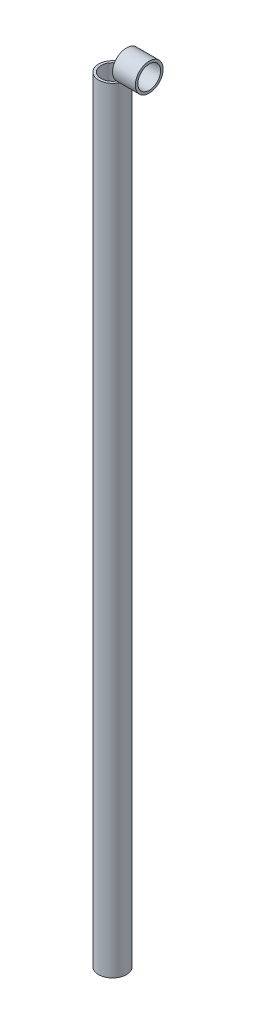
ISO-10303-21;
HEADER;
FILE_DESCRIPTION(('STEP AP214'),'2;1');
FILE_NAME('part.step','',(''),(''),'','','');
FILE_SCHEMA(('AUTOMOTIVE_DESIGN { 1 0 10303 214 1 1 1 1 }'));
ENDSEC;
DATA;
#1=APPLICATION_CONTEXT('core data for automotive mechanical design processes');
#2=APPLICATION_PROTOCOL_DEFINITION('international standard','automotive_design',2000,#1);
#3=PRODUCT_CONTEXT('',#1,'mechanical');
#4=PRODUCT('Part','Part','',(#3));
#5=PRODUCT_RELATED_PRODUCT_CATEGORY('part','',(#4));
#6=PRODUCT_DEFINITION_FORMATION('','',#4);
#7=PRODUCT_DEFINITION_CONTEXT('part definition',#1,'design');
#8=PRODUCT_DEFINITION('design','',#6,#7);
#9=PRODUCT_DEFINITION_SHAPE('','',#8);
#10=(LENGTH_UNIT() NAMED_UNIT(*) SI_UNIT(.MILLI.,.METRE.));
#11=(NAMED_UNIT(*) PLANE_ANGLE_UNIT() SI_UNIT($,.RADIAN.));
#12=(NAMED_UNIT(*) SI_UNIT($,.STERADIAN.) SOLID_ANGLE_UNIT());
#13=UNCERTAINTY_MEASURE_WITH_UNIT(LENGTH_MEASURE(1.E-05),#10,'distance_accuracy_value','');
#14=(GEOMETRIC_REPRESENTATION_CONTEXT(3) GLOBAL_UNCERTAINTY_ASSIGNED_CONTEXT((#13)) GLOBAL_UNIT_ASSIGNED_CONTEXT((#10,
#11,#12)) REPRESENTATION_CONTEXT('',''));
#15=CARTESIAN_POINT('',(0.,0.,0.));
#16=DIRECTION('',(0.,0.,1.));
#17=DIRECTION('',(1.,0.,0.));
#18=AXIS2_PLACEMENT_3D('',#15,#16,#17);
#19=CARTESIAN_POINT('',(46.0375,989.0125,0.));
#20=DIRECTION('',(1.,0.,0.));
#21=DIRECTION('',(0.,0.,-1.));
#22=AXIS2_PLACEMENT_3D('',#19,#20,#21);
#23=PLANE('',#22);
#24=CARTESIAN_POINT('',(46.0375,989.0125,0.));
#25=DIRECTION('',(1.,0.,0.));
#26=DIRECTION('',(0.,0.,-1.));
#27=AXIS2_PLACEMENT_3D('',#24,#25,#26);
#28=CIRCLE('',#27,17.4625);
#29=CARTESIAN_POINT('',(46.0375,989.0125,-17.4625));
#30=VERTEX_POINT('',#29);
#31=EDGE_CURVE('E11',#30,#30,#28,.T.);
#32=ORIENTED_EDGE('',*,*,#31,.T.);
#33=EDGE_LOOP('',(#32));
#34=FACE_BOUND('',#33,.T.);
#35=CARTESIAN_POINT('',(46.0375,989.0125,0.));
#36=DIRECTION('',(1.,0.,0.));
#37=DIRECTION('',(0.,0.,-1.));
#38=AXIS2_PLACEMENT_3D('',#35,#36,#37);
#39=CIRCLE('',#38,14.2875);
#40=CARTESIAN_POINT('',(46.0375,989.0125,-14.2875));
#41=VERTEX_POINT('',#40);
#42=EDGE_CURVE('E53',#41,#41,#39,.T.);
#43=ORIENTED_EDGE('',*,*,#42,.F.);
#44=EDGE_LOOP('',(#43));
#45=FACE_BOUND('',#44,.T.);
#46=ADVANCED_FACE('F42',(#34,#45),#23,.T.);
#47=CARTESIAN_POINT('',(17.4625,989.0125,0.));
#48=DIRECTION('',(1.,0.,0.));
#49=DIRECTION('',(0.,0.,-1.));
#50=AXIS2_PLACEMENT_3D('',#47,#48,#49);
#51=PLANE('',#50);
#52=CARTESIAN_POINT('',(17.4625,989.0125,0.));
#53=DIRECTION('',(1.,0.,0.));
#54=DIRECTION('',(0.,0.,-1.));
#55=AXIS2_PLACEMENT_3D('',#52,#53,#54);
#56=CIRCLE('',#55,17.4625);
#57=CARTESIAN_POINT('',(17.4625,989.0125,-17.4625));
#58=VERTEX_POINT('',#57);
#59=EDGE_CURVE('E46',#58,#58,#56,.T.);
#60=ORIENTED_EDGE('',*,*,#59,.F.);
#61=EDGE_LOOP('',(#60));
#62=FACE_BOUND('',#61,.T.);
#63=CARTESIAN_POINT('',(17.4625,989.0125,0.));
#64=DIRECTION('',(1.,0.,0.));
#65=DIRECTION('',(0.,0.,-1.));
#66=AXIS2_PLACEMENT_3D('',#63,#64,#65);
#67=CIRCLE('',#66,14.2875);
#68=CARTESIAN_POINT('',(17.4625,989.0125,-14.2875));
#69=VERTEX_POINT('',#68);
#70=EDGE_CURVE('E55',#69,#69,#67,.T.);
#71=ORIENTED_EDGE('',*,*,#70,.T.);
#72=EDGE_LOOP('',(#71));
#73=FACE_BOUND('',#72,.T.);
#74=ADVANCED_FACE('F65',(#62,#73),#51,.F.);
#75=CARTESIAN_POINT('',(46.0375,989.0125,0.));
#76=DIRECTION('',(-1.,0.,0.));
#77=DIRECTION('',(0.,0.,1.));
#78=AXIS2_PLACEMENT_3D('',#75,#76,#77);
#79=CYLINDRICAL_SURFACE('',#78,17.4625);
#80=ORIENTED_EDGE('',*,*,#31,.F.);
#81=EDGE_LOOP('',(#80));
#82=FACE_BOUND('',#81,.T.);
#83=ORIENTED_EDGE('',*,*,#59,.T.);
#84=EDGE_LOOP('',(#83));
#85=FACE_BOUND('',#84,.T.);
#86=ADVANCED_FACE('F44',(#82,#85),#79,.T.);
#87=CARTESIAN_POINT('',(46.0375,989.0125,0.));
#88=DIRECTION('',(-1.,0.,0.));
#89=DIRECTION('',(0.,0.,1.));
#90=AXIS2_PLACEMENT_3D('',#87,#88,#89);
#91=CYLINDRICAL_SURFACE('',#90,14.2875);
#92=ORIENTED_EDGE('',*,*,#42,.T.);
#93=EDGE_LOOP('',(#92));
#94=FACE_BOUND('',#93,.T.);
#95=ORIENTED_EDGE('',*,*,#70,.F.);
#96=EDGE_LOOP('',(#95));
#97=FACE_BOUND('',#96,.T.);
#98=ADVANCED_FACE('F61',(#94,#97),#91,.F.);
#99=CLOSED_SHELL('',(#46,#74,#86,#98));
#100=MANIFOLD_SOLID_BREP('B2',#99);
#101=CARTESIAN_POINT('',(0.,971.55,0.));
#102=DIRECTION('',(0.,1.,0.));
#103=DIRECTION('',(0.,0.,1.));
#104=AXIS2_PLACEMENT_3D('',#101,#102,#103);
#105=PLANE('',#104);
#106=CARTESIAN_POINT('',(0.,971.55,0.));
#107=DIRECTION('',(0.,1.,0.));
#108=DIRECTION('',(0.,0.,1.));
#109=AXIS2_PLACEMENT_3D('',#106,#107,#108);
#110=CIRCLE('',#109,17.4625);
#111=CARTESIAN_POINT('',(17.4625,971.55,0.));
#112=VERTEX_POINT('',#111);
#113=EDGE_CURVE('E40',#112,#112,#110,.T.);
#114=ORIENTED_EDGE('',*,*,#113,.T.);
#115=EDGE_LOOP('',(#114));
#116=FACE_BOUND('',#115,.T.);
#117=CARTESIAN_POINT('',(0.,971.55,0.));
#118=DIRECTION('',(0.,1.,0.));
#119=DIRECTION('',(0.,0.,1.));
#120=AXIS2_PLACEMENT_3D('',#117,#118,#119);
#121=CIRCLE('',#120,14.2875);
#122=CARTESIAN_POINT('',(0.,971.55,14.2875));
#123=VERTEX_POINT('',#122);
#124=EDGE_CURVE('E122',#123,#123,#121,.T.);
#125=ORIENTED_EDGE('',*,*,#124,.F.);
#126=EDGE_LOOP('',(#125));
#127=FACE_BOUND('',#126,.T.);
#128=ADVANCED_FACE('F103',(#116,#127),#105,.T.);
#129=CARTESIAN_POINT('',(0.,0.,0.));
#130=DIRECTION('',(0.,1.,0.));
#131=DIRECTION('',(0.,0.,1.));
#132=AXIS2_PLACEMENT_3D('',#129,#130,#131);
#133=PLANE('',#132);
#134=CARTESIAN_POINT('',(0.,0.,0.));
#135=DIRECTION('',(0.,1.,0.));
#136=DIRECTION('',(0.,0.,1.));
#137=AXIS2_PLACEMENT_3D('',#134,#135,#136);
#138=CIRCLE('',#137,17.4625);
#139=CARTESIAN_POINT('',(0.,0.,17.4625));
#140=VERTEX_POINT('',#139);
#141=EDGE_CURVE('E107',#140,#140,#138,.T.);
#142=ORIENTED_EDGE('',*,*,#141,.F.);
#143=EDGE_LOOP('',(#142));
#144=FACE_BOUND('',#143,.T.);
#145=CARTESIAN_POINT('',(0.,0.,0.));
#146=DIRECTION('',(0.,1.,0.));
#147=DIRECTION('',(0.,0.,1.));
#148=AXIS2_PLACEMENT_3D('',#145,#146,#147);
#149=CIRCLE('',#148,14.2875);
#150=CARTESIAN_POINT('',(0.,0.,14.2875));
#151=VERTEX_POINT('',#150);
#152=EDGE_CURVE('E124',#151,#151,#149,.T.);
#153=ORIENTED_EDGE('',*,*,#152,.T.);
#154=EDGE_LOOP('',(#153));
#155=FACE_BOUND('',#154,.T.);
#156=ADVANCED_FACE('F118',(#144,#155),#133,.F.);
#157=CARTESIAN_POINT('',(0.,971.55,0.));
#158=DIRECTION('',(0.,-1.,0.));
#159=DIRECTION('',(0.,0.,-1.));
#160=AXIS2_PLACEMENT_3D('',#157,#158,#159);
#161=CYLINDRICAL_SURFACE('',#160,17.4625);
#162=ORIENTED_EDGE('',*,*,#113,.F.);
#163=EDGE_LOOP('',(#162));
#164=FACE_BOUND('',#163,.T.);
#165=ORIENTED_EDGE('',*,*,#141,.T.);
#166=EDGE_LOOP('',(#165));
#167=FACE_BOUND('',#166,.T.);
#168=ADVANCED_FACE('F105',(#164,#167),#161,.T.);
#169=CARTESIAN_POINT('',(0.,971.55,0.));
#170=DIRECTION('',(0.,-1.,0.));
#171=DIRECTION('',(0.,0.,-1.));
#172=AXIS2_PLACEMENT_3D('',#169,#170,#171);
#173=CYLINDRICAL_SURFACE('',#172,14.2875);
#174=ORIENTED_EDGE('',*,*,#124,.T.);
#175=EDGE_LOOP('',(#174));
#176=FACE_BOUND('',#175,.T.);
#177=ORIENTED_EDGE('',*,*,#152,.F.);
#178=EDGE_LOOP('',(#177));
#179=FACE_BOUND('',#178,.T.);
#180=ADVANCED_FACE('F117',(#176,#179),#173,.F.);
#181=CLOSED_SHELL('',(#128,#156,#168,#180));
#182=MANIFOLD_SOLID_BREP('B6',#181);
#183=ADVANCED_BREP_SHAPE_REPRESENTATION('',(#18,#100,#182),#14);
#184=SHAPE_DEFINITION_REPRESENTATION(#9,#183);
ENDSEC;
END-ISO-10303-21;
